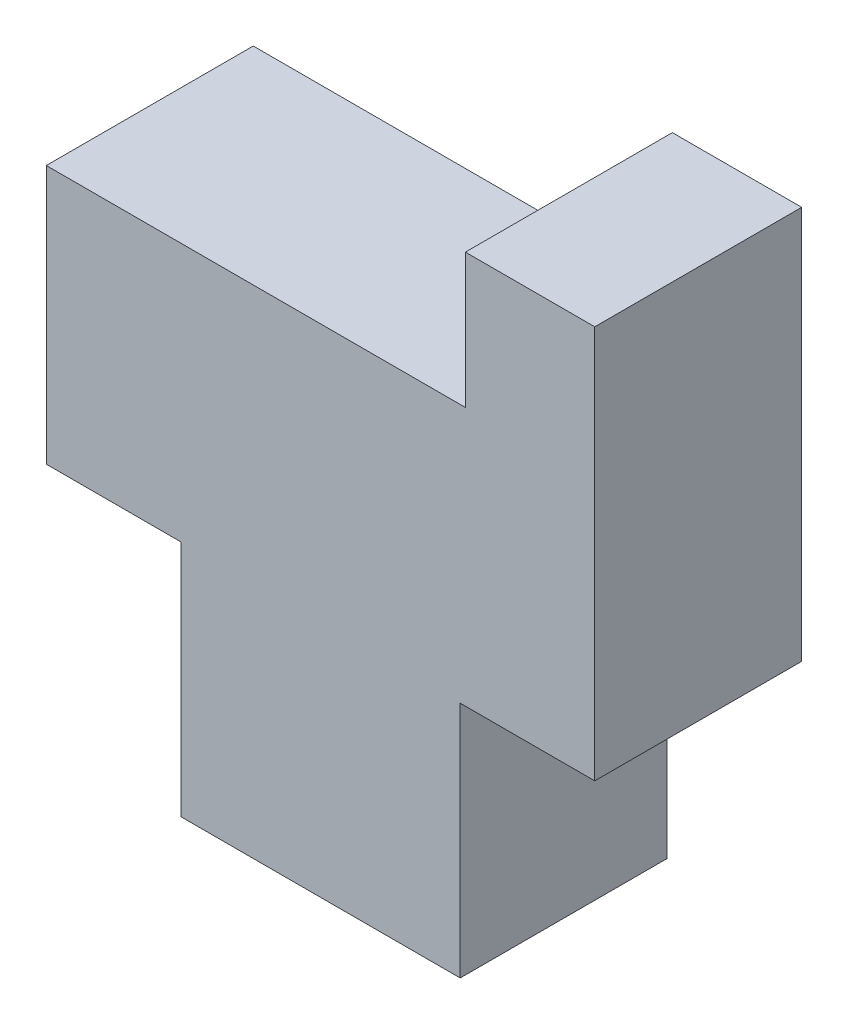
ISO-10303-21;
HEADER;
FILE_DESCRIPTION(('STEP AP214'),'2;1');
FILE_NAME('part.step','',(''),(''),'','','');
FILE_SCHEMA(('AUTOMOTIVE_DESIGN { 1 0 10303 214 1 1 1 1 }'));
ENDSEC;
DATA;
#1=APPLICATION_CONTEXT('core data for automotive mechanical design processes');
#2=APPLICATION_PROTOCOL_DEFINITION('international standard','automotive_design',2000,#1);
#3=PRODUCT_CONTEXT('',#1,'mechanical');
#4=PRODUCT('Part','Part','',(#3));
#5=PRODUCT_RELATED_PRODUCT_CATEGORY('part','',(#4));
#6=PRODUCT_DEFINITION_FORMATION('','',#4);
#7=PRODUCT_DEFINITION_CONTEXT('part definition',#1,'design');
#8=PRODUCT_DEFINITION('design','',#6,#7);
#9=PRODUCT_DEFINITION_SHAPE('','',#8);
#10=(LENGTH_UNIT() NAMED_UNIT(*) SI_UNIT(.MILLI.,.METRE.));
#11=(NAMED_UNIT(*) PLANE_ANGLE_UNIT() SI_UNIT($,.RADIAN.));
#12=(NAMED_UNIT(*) SI_UNIT($,.STERADIAN.) SOLID_ANGLE_UNIT());
#13=UNCERTAINTY_MEASURE_WITH_UNIT(LENGTH_MEASURE(1.E-05),#10,'distance_accuracy_value','');
#14=(GEOMETRIC_REPRESENTATION_CONTEXT(3) GLOBAL_UNCERTAINTY_ASSIGNED_CONTEXT((#13)) GLOBAL_UNIT_ASSIGNED_CONTEXT((#10,
#11,#12)) REPRESENTATION_CONTEXT('',''));
#15=CARTESIAN_POINT('',(0.,0.,0.));
#16=DIRECTION('',(0.,0.,1.));
#17=DIRECTION('',(1.,0.,0.));
#18=AXIS2_PLACEMENT_3D('',#15,#16,#17);
#19=CARTESIAN_POINT('',(0.,0.,4.));
#20=DIRECTION('',(1.,0.,0.));
#21=DIRECTION('',(0.,1.,0.));
#22=AXIS2_PLACEMENT_3D('',#19,#20,#21);
#23=PLANE('',#22);
#24=DIRECTION('',(0.,-1.,0.));
#25=VECTOR('',#24,1.);
#26=CARTESIAN_POINT('',(0.,0.,0.));
#27=LINE('',#26,#25);
#28=CARTESIAN_POINT('',(0.,4.6,0.));
#29=VERTEX_POINT('',#28);
#30=CARTESIAN_POINT('',(0.,0.,0.));
#31=VERTEX_POINT('',#30);
#32=EDGE_CURVE('E141',#29,#31,#27,.T.);
#33=ORIENTED_EDGE('',*,*,#32,.T.);
#34=DIRECTION('',(0.,0.,-1.));
#35=VECTOR('',#34,1.);
#36=CARTESIAN_POINT('',(0.,0.,4.));
#37=LINE('',#36,#35);
#38=CARTESIAN_POINT('',(0.,0.,4.));
#39=VERTEX_POINT('',#38);
#40=EDGE_CURVE('E11',#39,#31,#37,.T.);
#41=ORIENTED_EDGE('',*,*,#40,.F.);
#42=DIRECTION('',(0.,-1.,0.));
#43=VECTOR('',#42,1.);
#44=CARTESIAN_POINT('',(0.,0.,4.));
#45=LINE('',#44,#43);
#46=CARTESIAN_POINT('',(0.,4.6,4.));
#47=VERTEX_POINT('',#46);
#48=EDGE_CURVE('E159',#47,#39,#45,.T.);
#49=ORIENTED_EDGE('',*,*,#48,.F.);
#50=DIRECTION('',(0.,0.,-1.));
#51=VECTOR('',#50,1.);
#52=CARTESIAN_POINT('',(0.,4.6,4.));
#53=LINE('',#52,#51);
#54=EDGE_CURVE('E137',#47,#29,#53,.T.);
#55=ORIENTED_EDGE('',*,*,#54,.T.);
#56=EDGE_LOOP('',(#33,#41,#49,#55));
#57=FACE_BOUND('',#56,.T.);
#58=ADVANCED_FACE('F33',(#57),#23,.F.);
#59=CARTESIAN_POINT('',(0.,0.,4.));
#60=DIRECTION('',(0.,1.,0.));
#61=DIRECTION('',(-1.,0.,0.));
#62=AXIS2_PLACEMENT_3D('',#59,#60,#61);
#63=PLANE('',#62);
#64=DIRECTION('',(1.,0.,0.));
#65=VECTOR('',#64,1.);
#66=CARTESIAN_POINT('',(0.,0.,0.));
#67=LINE('',#66,#65);
#68=CARTESIAN_POINT('',(5.4,0.,0.));
#69=VERTEX_POINT('',#68);
#70=EDGE_CURVE('E144',#31,#69,#67,.T.);
#71=ORIENTED_EDGE('',*,*,#70,.T.);
#72=DIRECTION('',(0.,0.,-1.));
#73=VECTOR('',#72,1.);
#74=CARTESIAN_POINT('',(5.4,0.,4.));
#75=LINE('',#74,#73);
#76=CARTESIAN_POINT('',(5.4,0.,4.));
#77=VERTEX_POINT('',#76);
#78=EDGE_CURVE('E41',#77,#69,#75,.T.);
#79=ORIENTED_EDGE('',*,*,#78,.F.);
#80=DIRECTION('',(1.,0.,0.));
#81=VECTOR('',#80,1.);
#82=CARTESIAN_POINT('',(0.,0.,4.));
#83=LINE('',#82,#81);
#84=EDGE_CURVE('E98',#39,#77,#83,.T.);
#85=ORIENTED_EDGE('',*,*,#84,.F.);
#86=ORIENTED_EDGE('',*,*,#40,.T.);
#87=EDGE_LOOP('',(#71,#79,#85,#86));
#88=FACE_BOUND('',#87,.T.);
#89=ADVANCED_FACE('F208',(#88),#63,.F.);
#90=CARTESIAN_POINT('',(5.4,0.,4.));
#91=DIRECTION('',(-1.,0.,0.));
#92=DIRECTION('',(0.,-1.,0.));
#93=AXIS2_PLACEMENT_3D('',#90,#91,#92);
#94=PLANE('',#93);
#95=DIRECTION('',(0.,1.,0.));
#96=VECTOR('',#95,1.);
#97=CARTESIAN_POINT('',(5.4,0.,0.));
#98=LINE('',#97,#96);
#99=CARTESIAN_POINT('',(5.4,4.60000000000001,0.));
#100=VERTEX_POINT('',#99);
#101=EDGE_CURVE('E146',#69,#100,#98,.T.);
#102=ORIENTED_EDGE('',*,*,#101,.T.);
#103=DIRECTION('',(0.,0.,-1.));
#104=VECTOR('',#103,1.);
#105=CARTESIAN_POINT('',(5.4,4.60000000000001,4.));
#106=LINE('',#105,#104);
#107=CARTESIAN_POINT('',(5.4,4.60000000000001,4.));
#108=VERTEX_POINT('',#107);
#109=EDGE_CURVE('E172',#108,#100,#106,.T.);
#110=ORIENTED_EDGE('',*,*,#109,.F.);
#111=DIRECTION('',(0.,1.,0.));
#112=VECTOR('',#111,1.);
#113=CARTESIAN_POINT('',(5.4,0.,4.));
#114=LINE('',#113,#112);
#115=EDGE_CURVE('E180',#77,#108,#114,.T.);
#116=ORIENTED_EDGE('',*,*,#115,.F.);
#117=ORIENTED_EDGE('',*,*,#78,.T.);
#118=EDGE_LOOP('',(#102,#110,#116,#117));
#119=FACE_BOUND('',#118,.T.);
#120=ADVANCED_FACE('F178',(#119),#94,.F.);
#121=CARTESIAN_POINT('',(5.4,4.60000000000001,4.));
#122=DIRECTION('',(0.,1.,0.));
#123=DIRECTION('',(0.,0.,1.));
#124=AXIS2_PLACEMENT_3D('',#121,#122,#123);
#125=PLANE('',#124);
#126=DIRECTION('',(1.,0.,0.));
#127=VECTOR('',#126,1.);
#128=CARTESIAN_POINT('',(5.4,4.60000000000001,0.));
#129=LINE('',#128,#127);
#130=CARTESIAN_POINT('',(8.,4.60000000000001,0.));
#131=VERTEX_POINT('',#130);
#132=EDGE_CURVE('E148',#100,#131,#129,.T.);
#133=ORIENTED_EDGE('',*,*,#132,.T.);
#134=DIRECTION('',(0.,0.,-1.));
#135=VECTOR('',#134,1.);
#136=CARTESIAN_POINT('',(8.,4.60000000000001,4.));
#137=LINE('',#136,#135);
#138=CARTESIAN_POINT('',(8.,4.60000000000001,4.));
#139=VERTEX_POINT('',#138);
#140=EDGE_CURVE('E169',#139,#131,#137,.T.);
#141=ORIENTED_EDGE('',*,*,#140,.F.);
#142=DIRECTION('',(1.,0.,0.));
#143=VECTOR('',#142,1.);
#144=CARTESIAN_POINT('',(5.4,4.60000000000001,4.));
#145=LINE('',#144,#143);
#146=EDGE_CURVE('E198',#108,#139,#145,.T.);
#147=ORIENTED_EDGE('',*,*,#146,.F.);
#148=ORIENTED_EDGE('',*,*,#109,.T.);
#149=EDGE_LOOP('',(#133,#141,#147,#148));
#150=FACE_BOUND('',#149,.T.);
#151=ADVANCED_FACE('F189',(#150),#125,.F.);
#152=CARTESIAN_POINT('',(8.,12.2,4.));
#153=DIRECTION('',(-1.,0.,0.));
#154=DIRECTION('',(0.,-1.,0.));
#155=AXIS2_PLACEMENT_3D('',#152,#153,#154);
#156=PLANE('',#155);
#157=DIRECTION('',(0.,1.,0.));
#158=VECTOR('',#157,1.);
#159=CARTESIAN_POINT('',(8.,12.2,0.));
#160=LINE('',#159,#158);
#161=CARTESIAN_POINT('',(8.,12.2,0.));
#162=VERTEX_POINT('',#161);
#163=EDGE_CURVE('E150',#131,#162,#160,.T.);
#164=ORIENTED_EDGE('',*,*,#163,.T.);
#165=DIRECTION('',(0.,0.,-1.));
#166=VECTOR('',#165,1.);
#167=CARTESIAN_POINT('',(8.,12.2,4.));
#168=LINE('',#167,#166);
#169=CARTESIAN_POINT('',(8.,12.2,4.));
#170=VERTEX_POINT('',#169);
#171=EDGE_CURVE('E166',#170,#162,#168,.T.);
#172=ORIENTED_EDGE('',*,*,#171,.F.);
#173=DIRECTION('',(0.,1.,0.));
#174=VECTOR('',#173,1.);
#175=CARTESIAN_POINT('',(8.,12.2,4.));
#176=LINE('',#175,#174);
#177=EDGE_CURVE('E195',#139,#170,#176,.T.);
#178=ORIENTED_EDGE('',*,*,#177,.F.);
#179=ORIENTED_EDGE('',*,*,#140,.T.);
#180=EDGE_LOOP('',(#164,#172,#178,#179));
#181=FACE_BOUND('',#180,.T.);
#182=ADVANCED_FACE('F193',(#181),#156,.F.);
#183=CARTESIAN_POINT('',(5.49999999999999,12.2,4.));
#184=DIRECTION('',(0.,-1.,0.));
#185=DIRECTION('',(0.,0.,-1.));
#186=AXIS2_PLACEMENT_3D('',#183,#184,#185);
#187=PLANE('',#186);
#188=DIRECTION('',(-1.,0.,0.));
#189=VECTOR('',#188,1.);
#190=CARTESIAN_POINT('',(5.49999999999999,12.2,0.));
#191=LINE('',#190,#189);
#192=CARTESIAN_POINT('',(5.49999999999999,12.2,0.));
#193=VERTEX_POINT('',#192);
#194=EDGE_CURVE('E152',#162,#193,#191,.T.);
#195=ORIENTED_EDGE('',*,*,#194,.T.);
#196=DIRECTION('',(0.,0.,-1.));
#197=VECTOR('',#196,1.);
#198=CARTESIAN_POINT('',(5.49999999999999,12.2,4.));
#199=LINE('',#198,#197);
#200=CARTESIAN_POINT('',(5.49999999999999,12.2,4.));
#201=VERTEX_POINT('',#200);
#202=EDGE_CURVE('E163',#201,#193,#199,.T.);
#203=ORIENTED_EDGE('',*,*,#202,.F.);
#204=DIRECTION('',(-1.,0.,0.));
#205=VECTOR('',#204,1.);
#206=CARTESIAN_POINT('',(5.49999999999999,12.2,4.));
#207=LINE('',#206,#205);
#208=EDGE_CURVE('E197',#170,#201,#207,.T.);
#209=ORIENTED_EDGE('',*,*,#208,.F.);
#210=ORIENTED_EDGE('',*,*,#171,.T.);
#211=EDGE_LOOP('',(#195,#203,#209,#210));
#212=FACE_BOUND('',#211,.T.);
#213=ADVANCED_FACE('F220',(#212),#187,.F.);
#214=CARTESIAN_POINT('',(5.49999999999999,9.6,4.));
#215=DIRECTION('',(1.,0.,0.));
#216=DIRECTION('',(0.,0.,-1.));
#217=AXIS2_PLACEMENT_3D('',#214,#215,#216);
#218=PLANE('',#217);
#219=DIRECTION('',(0.,-1.,0.));
#220=VECTOR('',#219,1.);
#221=CARTESIAN_POINT('',(5.49999999999999,9.6,0.));
#222=LINE('',#221,#220);
#223=CARTESIAN_POINT('',(5.49999999999999,9.6,0.));
#224=VERTEX_POINT('',#223);
#225=EDGE_CURVE('E154',#193,#224,#222,.T.);
#226=ORIENTED_EDGE('',*,*,#225,.T.);
#227=DIRECTION('',(0.,0.,-1.));
#228=VECTOR('',#227,1.);
#229=CARTESIAN_POINT('',(5.49999999999999,9.6,4.));
#230=LINE('',#229,#228);
#231=CARTESIAN_POINT('',(5.49999999999999,9.6,4.));
#232=VERTEX_POINT('',#231);
#233=EDGE_CURVE('E132',#232,#224,#230,.T.);
#234=ORIENTED_EDGE('',*,*,#233,.F.);
#235=DIRECTION('',(0.,-1.,0.));
#236=VECTOR('',#235,1.);
#237=CARTESIAN_POINT('',(5.49999999999999,9.6,4.));
#238=LINE('',#237,#236);
#239=EDGE_CURVE('E123',#201,#232,#238,.T.);
#240=ORIENTED_EDGE('',*,*,#239,.F.);
#241=ORIENTED_EDGE('',*,*,#202,.T.);
#242=EDGE_LOOP('',(#226,#234,#240,#241));
#243=FACE_BOUND('',#242,.T.);
#244=ADVANCED_FACE('F223',(#243),#218,.F.);
#245=CARTESIAN_POINT('',(-2.6,9.6,4.));
#246=DIRECTION('',(0.,-1.,0.));
#247=DIRECTION('',(0.,0.,-1.));
#248=AXIS2_PLACEMENT_3D('',#245,#246,#247);
#249=PLANE('',#248);
#250=DIRECTION('',(-1.,0.,0.));
#251=VECTOR('',#250,1.);
#252=CARTESIAN_POINT('',(-2.6,9.6,0.));
#253=LINE('',#252,#251);
#254=CARTESIAN_POINT('',(-2.6,9.6,0.));
#255=VERTEX_POINT('',#254);
#256=EDGE_CURVE('E131',#224,#255,#253,.T.);
#257=ORIENTED_EDGE('',*,*,#256,.T.);
#258=DIRECTION('',(0.,0.,-1.));
#259=VECTOR('',#258,1.);
#260=CARTESIAN_POINT('',(-2.6,9.6,4.));
#261=LINE('',#260,#259);
#262=CARTESIAN_POINT('',(-2.6,9.6,4.));
#263=VERTEX_POINT('',#262);
#264=EDGE_CURVE('E128',#263,#255,#261,.T.);
#265=ORIENTED_EDGE('',*,*,#264,.F.);
#266=DIRECTION('',(-1.,0.,0.));
#267=VECTOR('',#266,1.);
#268=CARTESIAN_POINT('',(-2.6,9.6,4.));
#269=LINE('',#268,#267);
#270=EDGE_CURVE('E117',#232,#263,#269,.T.);
#271=ORIENTED_EDGE('',*,*,#270,.F.);
#272=ORIENTED_EDGE('',*,*,#233,.T.);
#273=EDGE_LOOP('',(#257,#265,#271,#272));
#274=FACE_BOUND('',#273,.T.);
#275=ADVANCED_FACE('F129',(#274),#249,.F.);
#276=CARTESIAN_POINT('',(-2.6,4.6,4.));
#277=DIRECTION('',(1.,0.,0.));
#278=DIRECTION('',(0.,0.,-1.));
#279=AXIS2_PLACEMENT_3D('',#276,#277,#278);
#280=PLANE('',#279);
#281=DIRECTION('',(0.,-1.,0.));
#282=VECTOR('',#281,1.);
#283=CARTESIAN_POINT('',(-2.6,4.6,0.));
#284=LINE('',#283,#282);
#285=CARTESIAN_POINT('',(-2.6,4.6,0.));
#286=VERTEX_POINT('',#285);
#287=EDGE_CURVE('E84',#255,#286,#284,.T.);
#288=ORIENTED_EDGE('',*,*,#287,.T.);
#289=DIRECTION('',(0.,0.,-1.));
#290=VECTOR('',#289,1.);
#291=CARTESIAN_POINT('',(-2.6,4.6,4.));
#292=LINE('',#291,#290);
#293=CARTESIAN_POINT('',(-2.6,4.6,4.));
#294=VERTEX_POINT('',#293);
#295=EDGE_CURVE('E133',#294,#286,#292,.T.);
#296=ORIENTED_EDGE('',*,*,#295,.F.);
#297=DIRECTION('',(0.,-1.,0.));
#298=VECTOR('',#297,1.);
#299=CARTESIAN_POINT('',(-2.6,4.6,4.));
#300=LINE('',#299,#298);
#301=EDGE_CURVE('E121',#263,#294,#300,.T.);
#302=ORIENTED_EDGE('',*,*,#301,.F.);
#303=ORIENTED_EDGE('',*,*,#264,.T.);
#304=EDGE_LOOP('',(#288,#296,#302,#303));
#305=FACE_BOUND('',#304,.T.);
#306=ADVANCED_FACE('F135',(#305),#280,.F.);
#307=CARTESIAN_POINT('',(0.,4.6,4.));
#308=DIRECTION('',(0.,1.,0.));
#309=DIRECTION('',(0.,0.,1.));
#310=AXIS2_PLACEMENT_3D('',#307,#308,#309);
#311=PLANE('',#310);
#312=DIRECTION('',(1.,0.,0.));
#313=VECTOR('',#312,1.);
#314=CARTESIAN_POINT('',(0.,4.6,0.));
#315=LINE('',#314,#313);
#316=EDGE_CURVE('E90',#286,#29,#315,.T.);
#317=ORIENTED_EDGE('',*,*,#316,.T.);
#318=ORIENTED_EDGE('',*,*,#54,.F.);
#319=DIRECTION('',(1.,0.,0.));
#320=VECTOR('',#319,1.);
#321=CARTESIAN_POINT('',(0.,4.6,4.));
#322=LINE('',#321,#320);
#323=EDGE_CURVE('E49',#294,#47,#322,.T.);
#324=ORIENTED_EDGE('',*,*,#323,.F.);
#325=ORIENTED_EDGE('',*,*,#295,.T.);
#326=EDGE_LOOP('',(#317,#318,#324,#325));
#327=FACE_BOUND('',#326,.T.);
#328=ADVANCED_FACE('F232',(#327),#311,.F.);
#329=CARTESIAN_POINT('',(0.,0.,4.));
#330=DIRECTION('',(0.,0.,1.));
#331=DIRECTION('',(1.,0.,0.));
#332=AXIS2_PLACEMENT_3D('',#329,#330,#331);
#333=PLANE('',#332);
#334=ORIENTED_EDGE('',*,*,#48,.T.);
#335=ORIENTED_EDGE('',*,*,#84,.T.);
#336=ORIENTED_EDGE('',*,*,#115,.T.);
#337=ORIENTED_EDGE('',*,*,#146,.T.);
#338=ORIENTED_EDGE('',*,*,#177,.T.);
#339=ORIENTED_EDGE('',*,*,#208,.T.);
#340=ORIENTED_EDGE('',*,*,#239,.T.);
#341=ORIENTED_EDGE('',*,*,#270,.T.);
#342=ORIENTED_EDGE('',*,*,#301,.T.);
#343=ORIENTED_EDGE('',*,*,#323,.T.);
#344=EDGE_LOOP('',(#334,#335,#336,#337,#338,#339,#340,#341,#342,#343));
#345=FACE_BOUND('',#344,.T.);
#346=ADVANCED_FACE('F119',(#345),#333,.T.);
#347=CARTESIAN_POINT('',(0.,0.,0.));
#348=DIRECTION('',(0.,0.,1.));
#349=DIRECTION('',(1.,0.,0.));
#350=AXIS2_PLACEMENT_3D('',#347,#348,#349);
#351=PLANE('',#350);
#352=ORIENTED_EDGE('',*,*,#32,.F.);
#353=ORIENTED_EDGE('',*,*,#316,.F.);
#354=ORIENTED_EDGE('',*,*,#287,.F.);
#355=ORIENTED_EDGE('',*,*,#256,.F.);
#356=ORIENTED_EDGE('',*,*,#225,.F.);
#357=ORIENTED_EDGE('',*,*,#194,.F.);
#358=ORIENTED_EDGE('',*,*,#163,.F.);
#359=ORIENTED_EDGE('',*,*,#132,.F.);
#360=ORIENTED_EDGE('',*,*,#101,.F.);
#361=ORIENTED_EDGE('',*,*,#70,.F.);
#362=EDGE_LOOP('',(#352,#353,#354,#355,#356,#357,#358,#359,#360,#361));
#363=FACE_BOUND('',#362,.T.);
#364=ADVANCED_FACE('F184',(#363),#351,.F.);
#365=CLOSED_SHELL('',(#58,#89,#120,#151,#182,#213,#244,#275,#306,#328,#346,#364));
#366=MANIFOLD_SOLID_BREP('B2',#365);
#367=ADVANCED_BREP_SHAPE_REPRESENTATION('',(#18,#366),#14);
#368=SHAPE_DEFINITION_REPRESENTATION(#9,#367);
ENDSEC;
END-ISO-10303-21;
